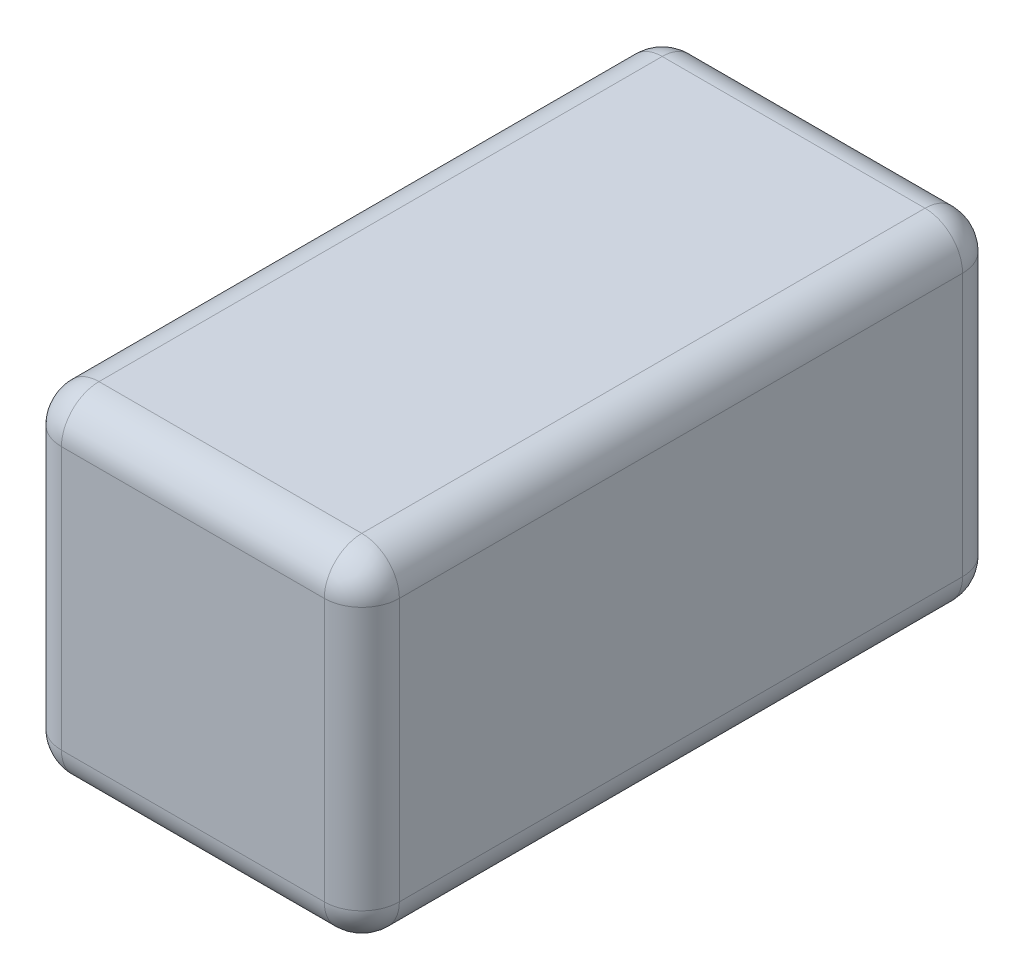
ISO-10303-21;
HEADER;
FILE_DESCRIPTION(('STEP AP214'),'2;1');
FILE_NAME('part.step','',(''),(''),'','','');
FILE_SCHEMA(('AUTOMOTIVE_DESIGN { 1 0 10303 214 1 1 1 1 }'));
ENDSEC;
DATA;
#1=APPLICATION_CONTEXT('core data for automotive mechanical design processes');
#2=APPLICATION_PROTOCOL_DEFINITION('international standard','automotive_design',2000,#1);
#3=PRODUCT_CONTEXT('',#1,'mechanical');
#4=PRODUCT('Part','Part','',(#3));
#5=PRODUCT_RELATED_PRODUCT_CATEGORY('part','',(#4));
#6=PRODUCT_DEFINITION_FORMATION('','',#4);
#7=PRODUCT_DEFINITION_CONTEXT('part definition',#1,'design');
#8=PRODUCT_DEFINITION('design','',#6,#7);
#9=PRODUCT_DEFINITION_SHAPE('','',#8);
#10=(LENGTH_UNIT() NAMED_UNIT(*) SI_UNIT(.MILLI.,.METRE.));
#11=(NAMED_UNIT(*) PLANE_ANGLE_UNIT() SI_UNIT($,.RADIAN.));
#12=(NAMED_UNIT(*) SI_UNIT($,.STERADIAN.) SOLID_ANGLE_UNIT());
#13=UNCERTAINTY_MEASURE_WITH_UNIT(LENGTH_MEASURE(1.E-05),#10,'distance_accuracy_value','');
#14=(GEOMETRIC_REPRESENTATION_CONTEXT(3) GLOBAL_UNCERTAINTY_ASSIGNED_CONTEXT((#13)) GLOBAL_UNIT_ASSIGNED_CONTEXT((#10,
#11,#12)) REPRESENTATION_CONTEXT('',''));
#15=CARTESIAN_POINT('',(0.,0.,0.));
#16=DIRECTION('',(0.,0.,1.));
#17=DIRECTION('',(1.,0.,0.));
#18=AXIS2_PLACEMENT_3D('',#15,#16,#17);
#19=CARTESIAN_POINT('',(-7.777710128787,-22.06241513081,2.799162858095));
#20=DIRECTION('',(1.,0.,0.));
#21=DIRECTION('',(0.,0.,-1.));
#22=AXIS2_PLACEMENT_3D('',#19,#20,#21);
#23=SPHERICAL_SURFACE('',#22,0.1);
#24=CARTESIAN_POINT('',(-7.777710128787,-22.06241513081,2.799162858095));
#25=DIRECTION('',(0.,0.,1.));
#26=DIRECTION('',(1.,0.,0.));
#27=AXIS2_PLACEMENT_3D('',#24,#25,#26);
#28=CIRCLE('',#27,0.1);
#29=CARTESIAN_POINT('',(-7.677710128787,-22.062415130705,2.799162858095));
#30=VERTEX_POINT('',#29);
#31=CARTESIAN_POINT('',(-7.7777101286765,-21.96241513081,2.799162858095));
#32=VERTEX_POINT('',#31);
#33=EDGE_CURVE('E91',#30,#32,#28,.T.);
#34=ORIENTED_EDGE('',*,*,#33,.F.);
#35=CARTESIAN_POINT('',(-7.777710128787,-22.06241513081,2.799162858095));
#36=DIRECTION('',(0.,1.,0.));
#37=DIRECTION('',(-1.,0.,0.));
#38=AXIS2_PLACEMENT_3D('',#35,#36,#37);
#39=CIRCLE('',#38,0.1);
#40=CARTESIAN_POINT('',(-7.777710128787,-22.06241513081,2.699162858095));
#41=VERTEX_POINT('',#40);
#42=EDGE_CURVE('E87',#41,#30,#39,.F.);
#43=ORIENTED_EDGE('',*,*,#42,.F.);
#44=CARTESIAN_POINT('',(-7.777710128787,-22.06241513081,2.799162858095));
#45=DIRECTION('',(1.,0.,0.));
#46=DIRECTION('',(0.,0.,-1.));
#47=AXIS2_PLACEMENT_3D('',#44,#45,#46);
#48=CIRCLE('',#47,0.1);
#49=EDGE_CURVE('E89',#32,#41,#48,.F.);
#50=ORIENTED_EDGE('',*,*,#49,.F.);
#51=EDGE_LOOP('',(#34,#43,#50));
#52=FACE_BOUND('',#51,.T.);
#53=ADVANCED_FACE('F17',(#52),#23,.T.);
#54=CARTESIAN_POINT('',(-7.777710128787,-22.06241513081,4.299162858095));
#55=DIRECTION('',(0.,0.,1.));
#56=DIRECTION('',(1.,0.,0.));
#57=AXIS2_PLACEMENT_3D('',#54,#55,#56);
#58=SPHERICAL_SURFACE('',#57,0.1);
#59=CARTESIAN_POINT('',(-7.777710128787,-22.06241513081,4.299162858095));
#60=DIRECTION('',(0.,-1.,0.));
#61=DIRECTION('',(1.,0.,0.));
#62=AXIS2_PLACEMENT_3D('',#59,#60,#61);
#63=CIRCLE('',#62,0.1);
#64=CARTESIAN_POINT('',(-7.677710128787,-22.06241513081,4.299162858095));
#65=VERTEX_POINT('',#64);
#66=CARTESIAN_POINT('',(-7.777710128787,-22.06241513081,4.399162858095));
#67=VERTEX_POINT('',#66);
#68=EDGE_CURVE('E53',#65,#67,#63,.T.);
#69=ORIENTED_EDGE('',*,*,#68,.F.);
#70=CARTESIAN_POINT('',(-7.777710128787,-22.06241513081,4.299162858095));
#71=DIRECTION('',(0.,0.,1.));
#72=DIRECTION('',(1.,0.,0.));
#73=AXIS2_PLACEMENT_3D('',#70,#71,#72);
#74=CIRCLE('',#73,0.1);
#75=CARTESIAN_POINT('',(-7.777710128732,-21.96241513081,4.299162858095));
#76=VERTEX_POINT('',#75);
#77=EDGE_CURVE('E120',#76,#65,#74,.F.);
#78=ORIENTED_EDGE('',*,*,#77,.F.);
#79=CARTESIAN_POINT('',(-7.777710128787,-22.06241513081,4.299162858095));
#80=DIRECTION('',(1.,0.,0.));
#81=DIRECTION('',(0.,0.,-1.));
#82=AXIS2_PLACEMENT_3D('',#79,#80,#81);
#83=CIRCLE('',#82,0.1);
#84=EDGE_CURVE('E105',#67,#76,#83,.F.);
#85=ORIENTED_EDGE('',*,*,#84,.F.);
#86=EDGE_LOOP('',(#69,#78,#85));
#87=FACE_BOUND('',#86,.T.);
#88=ADVANCED_FACE('F203',(#87),#58,.T.);
#89=CARTESIAN_POINT('',(-7.777710128787,-21.56241513081,2.799162858095));
#90=DIRECTION('',(0.,1.,0.));
#91=DIRECTION('',(-1.,0.,0.));
#92=AXIS2_PLACEMENT_3D('',#89,#90,#91);
#93=CYLINDRICAL_SURFACE('',#92,0.1);
#94=CARTESIAN_POINT('',(-7.777710128787,-22.76241513081,2.799162858095));
#95=DIRECTION('',(0.,-1.,0.));
#96=DIRECTION('',(0.,0.,-1.));
#97=AXIS2_PLACEMENT_3D('',#94,#95,#96);
#98=CIRCLE('',#97,0.1);
#99=CARTESIAN_POINT('',(-7.777710128787,-22.76241513081,2.699162858095));
#100=VERTEX_POINT('',#99);
#101=CARTESIAN_POINT('',(-7.677710128787,-22.76241513081,2.799162858095));
#102=VERTEX_POINT('',#101);
#103=EDGE_CURVE('E80',#100,#102,#98,.T.);
#104=ORIENTED_EDGE('',*,*,#103,.F.);
#105=DIRECTION('',(0.,1.,0.));
#106=VECTOR('',#105,1.);
#107=CARTESIAN_POINT('',(-7.777710128787,-21.96241513081,2.699162858095));
#108=LINE('',#107,#106);
#109=EDGE_CURVE('E107',#41,#100,#108,.F.);
#110=ORIENTED_EDGE('',*,*,#109,.F.);
#111=ORIENTED_EDGE('',*,*,#42,.T.);
#112=DIRECTION('',(0.,1.,0.));
#113=VECTOR('',#112,1.);
#114=CARTESIAN_POINT('',(-7.677710128787,-22.86241513081,2.799162858095));
#115=LINE('',#114,#113);
#116=EDGE_CURVE('E158',#30,#102,#115,.F.);
#117=ORIENTED_EDGE('',*,*,#116,.T.);
#118=EDGE_LOOP('',(#104,#110,#111,#117));
#119=FACE_BOUND('',#118,.T.);
#120=ADVANCED_FACE('F108',(#119),#93,.T.);
#121=CARTESIAN_POINT('',(-7.777710128787,-22.76241513081,2.799162858095));
#122=DIRECTION('',(0.,0.,-1.));
#123=DIRECTION('',(1.,0.,0.));
#124=AXIS2_PLACEMENT_3D('',#121,#122,#123);
#125=SPHERICAL_SURFACE('',#124,0.1);
#126=CARTESIAN_POINT('',(-7.777710128787,-22.76241513081,2.799162858095));
#127=DIRECTION('',(0.,0.,-1.));
#128=DIRECTION('',(-1.,0.,0.));
#129=AXIS2_PLACEMENT_3D('',#126,#127,#128);
#130=CIRCLE('',#129,0.1);
#131=CARTESIAN_POINT('',(-7.77771012875925,-22.86241513081,2.799162858095));
#132=VERTEX_POINT('',#131);
#133=EDGE_CURVE('E192',#132,#102,#130,.F.);
#134=ORIENTED_EDGE('',*,*,#133,.F.);
#135=CARTESIAN_POINT('',(-7.777710128787,-22.76241513081,2.799162858095));
#136=DIRECTION('',(1.,0.,0.));
#137=DIRECTION('',(0.,0.,-1.));
#138=AXIS2_PLACEMENT_3D('',#135,#136,#137);
#139=CIRCLE('',#138,0.1);
#140=EDGE_CURVE('E189',#100,#132,#139,.F.);
#141=ORIENTED_EDGE('',*,*,#140,.F.);
#142=ORIENTED_EDGE('',*,*,#103,.T.);
#143=EDGE_LOOP('',(#134,#141,#142));
#144=FACE_BOUND('',#143,.T.);
#145=ADVANCED_FACE('F176',(#144),#125,.T.);
#146=CARTESIAN_POINT('',(-7.677710128787,-22.86241513081,3.549162858095));
#147=DIRECTION('',(-1.,0.,0.));
#148=DIRECTION('',(0.,0.,1.));
#149=AXIS2_PLACEMENT_3D('',#146,#147,#148);
#150=PLANE('',#149);
#151=DIRECTION('',(0.,0.,-1.));
#152=VECTOR('',#151,1.);
#153=CARTESIAN_POINT('',(-7.677710128787,-22.76241513103,2.399162858095));
#154=LINE('',#153,#152);
#155=CARTESIAN_POINT('',(-7.677710128787,-22.76241513092,4.299162858095));
#156=VERTEX_POINT('',#155);
#157=EDGE_CURVE('E163',#102,#156,#154,.F.);
#158=ORIENTED_EDGE('',*,*,#157,.F.);
#159=ORIENTED_EDGE('',*,*,#116,.F.);
#160=DIRECTION('',(0.,0.,1.));
#161=VECTOR('',#160,1.);
#162=CARTESIAN_POINT('',(-7.677710128787,-22.06241513081,3.549162858095));
#163=LINE('',#162,#161);
#164=EDGE_CURVE('E21',#65,#30,#163,.F.);
#165=ORIENTED_EDGE('',*,*,#164,.F.);
#166=DIRECTION('',(0.,-1.,0.));
#167=VECTOR('',#166,1.);
#168=CARTESIAN_POINT('',(-7.677710128787,-23.26241513081,4.299162858095));
#169=LINE('',#168,#167);
#170=EDGE_CURVE('E61',#156,#65,#169,.F.);
#171=ORIENTED_EDGE('',*,*,#170,.F.);
#172=EDGE_LOOP('',(#158,#159,#165,#171));
#173=FACE_BOUND('',#172,.T.);
#174=ADVANCED_FACE('F171',(#173),#150,.F.);
#175=CARTESIAN_POINT('',(-7.777710128787,-22.76241513081,4.299162858095));
#176=DIRECTION('',(1.,0.,0.));
#177=DIRECTION('',(0.,0.,1.));
#178=AXIS2_PLACEMENT_3D('',#175,#176,#177);
#179=SPHERICAL_SURFACE('',#178,0.1);
#180=CARTESIAN_POINT('',(-7.777710128787,-22.76241513081,4.299162858095));
#181=DIRECTION('',(0.,-1.,0.));
#182=DIRECTION('',(1.,0.,0.));
#183=AXIS2_PLACEMENT_3D('',#180,#181,#182);
#184=CIRCLE('',#183,0.1);
#185=CARTESIAN_POINT('',(-7.777710128787,-22.76241513081,4.399162858095));
#186=VERTEX_POINT('',#185);
#187=EDGE_CURVE('E152',#186,#156,#184,.F.);
#188=ORIENTED_EDGE('',*,*,#187,.F.);
#189=CARTESIAN_POINT('',(-7.777710128787,-22.76241513081,4.299162858095));
#190=DIRECTION('',(1.,0.,0.));
#191=DIRECTION('',(0.,0.,-1.));
#192=AXIS2_PLACEMENT_3D('',#189,#190,#191);
#193=CIRCLE('',#192,0.1);
#194=CARTESIAN_POINT('',(-7.7777101286765,-22.86241513081,4.299162858095));
#195=VERTEX_POINT('',#194);
#196=EDGE_CURVE('E112',#195,#186,#193,.F.);
#197=ORIENTED_EDGE('',*,*,#196,.F.);
#198=CARTESIAN_POINT('',(-7.777710128787,-22.76241513081,4.299162858095));
#199=DIRECTION('',(0.,0.,-1.));
#200=DIRECTION('',(-1.,0.,0.));
#201=AXIS2_PLACEMENT_3D('',#198,#199,#200);
#202=CIRCLE('',#201,0.1);
#203=EDGE_CURVE('E329',#156,#195,#202,.T.);
#204=ORIENTED_EDGE('',*,*,#203,.F.);
#205=EDGE_LOOP('',(#188,#197,#204));
#206=FACE_BOUND('',#205,.T.);
#207=ADVANCED_FACE('F166',(#206),#179,.T.);
#208=CARTESIAN_POINT('',(-7.777710128787,-23.26241513081,4.299162858095));
#209=DIRECTION('',(0.,-1.,0.));
#210=DIRECTION('',(1.,0.,0.));
#211=AXIS2_PLACEMENT_3D('',#208,#209,#210);
#212=CYLINDRICAL_SURFACE('',#211,0.1);
#213=ORIENTED_EDGE('',*,*,#187,.T.);
#214=ORIENTED_EDGE('',*,*,#170,.T.);
#215=ORIENTED_EDGE('',*,*,#68,.T.);
#216=DIRECTION('',(0.,1.,0.));
#217=VECTOR('',#216,1.);
#218=CARTESIAN_POINT('',(-7.777710128787,-22.86241513081,4.399162858095));
#219=LINE('',#218,#217);
#220=EDGE_CURVE('E146',#186,#67,#219,.T.);
#221=ORIENTED_EDGE('',*,*,#220,.F.);
#222=EDGE_LOOP('',(#213,#214,#215,#221));
#223=FACE_BOUND('',#222,.T.);
#224=ADVANCED_FACE('F170',(#223),#212,.T.);
#225=CARTESIAN_POINT('',(-7.377710128787,-22.06241513081,2.799162858095));
#226=DIRECTION('',(1.,0.,0.));
#227=DIRECTION('',(0.,0.,-1.));
#228=AXIS2_PLACEMENT_3D('',#225,#226,#227);
#229=CYLINDRICAL_SURFACE('',#228,0.1);
#230=DIRECTION('',(-1.,0.,0.));
#231=VECTOR('',#230,1.);
#232=CARTESIAN_POINT('',(-7.677710128787,-22.06241513081,2.699162858095));
#233=LINE('',#232,#231);
#234=CARTESIAN_POINT('',(-8.477710128787,-22.06241513081,2.699162858095));
#235=VERTEX_POINT('',#234);
#236=EDGE_CURVE('E101',#235,#41,#233,.F.);
#237=ORIENTED_EDGE('',*,*,#236,.F.);
#238=CARTESIAN_POINT('',(-8.477710128787,-22.06241513081,2.799162858095));
#239=DIRECTION('',(1.,0.,0.));
#240=DIRECTION('',(0.,0.,-1.));
#241=AXIS2_PLACEMENT_3D('',#238,#239,#240);
#242=CIRCLE('',#241,0.1);
#243=CARTESIAN_POINT('',(-8.477710128897,-21.96241513081,2.799162858095));
#244=VERTEX_POINT('',#243);
#245=EDGE_CURVE('E308',#244,#235,#242,.F.);
#246=ORIENTED_EDGE('',*,*,#245,.F.);
#247=DIRECTION('',(-1.,0.,0.));
#248=VECTOR('',#247,1.);
#249=CARTESIAN_POINT('',(-7.677710128787,-21.96241513081,2.799162858095));
#250=LINE('',#249,#248);
#251=EDGE_CURVE('E104',#32,#244,#250,.T.);
#252=ORIENTED_EDGE('',*,*,#251,.F.);
#253=ORIENTED_EDGE('',*,*,#49,.T.);
#254=EDGE_LOOP('',(#237,#246,#252,#253));
#255=FACE_BOUND('',#254,.T.);
#256=ADVANCED_FACE('F97',(#255),#229,.T.);
#257=CARTESIAN_POINT('',(-7.377710128787,-22.06241513081,4.299162858095));
#258=DIRECTION('',(1.,0.,0.));
#259=DIRECTION('',(0.,0.,-1.));
#260=AXIS2_PLACEMENT_3D('',#257,#258,#259);
#261=CYLINDRICAL_SURFACE('',#260,0.1);
#262=DIRECTION('',(-1.,0.,0.));
#263=VECTOR('',#262,1.);
#264=CARTESIAN_POINT('',(-7.677710128787,-21.96241513081,4.299162858095));
#265=LINE('',#264,#263);
#266=CARTESIAN_POINT('',(-8.477710128787,-21.96241513081,4.299162858095));
#267=VERTEX_POINT('',#266);
#268=EDGE_CURVE('E141',#267,#76,#265,.F.);
#269=ORIENTED_EDGE('',*,*,#268,.F.);
#270=CARTESIAN_POINT('',(-8.477710128787,-22.06241513081,4.299162858095));
#271=DIRECTION('',(-1.,0.,0.));
#272=DIRECTION('',(0.,0.,1.));
#273=AXIS2_PLACEMENT_3D('',#270,#271,#272);
#274=CIRCLE('',#273,0.1);
#275=CARTESIAN_POINT('',(-8.477710128787,-22.06241513081,4.399162858095));
#276=VERTEX_POINT('',#275);
#277=EDGE_CURVE('E287',#276,#267,#274,.T.);
#278=ORIENTED_EDGE('',*,*,#277,.F.);
#279=DIRECTION('',(1.,0.,0.));
#280=VECTOR('',#279,1.);
#281=CARTESIAN_POINT('',(-7.677710128787,-22.06241513081,4.399162858095));
#282=LINE('',#281,#280);
#283=EDGE_CURVE('E324',#67,#276,#282,.F.);
#284=ORIENTED_EDGE('',*,*,#283,.F.);
#285=ORIENTED_EDGE('',*,*,#84,.T.);
#286=EDGE_LOOP('',(#269,#278,#284,#285));
#287=FACE_BOUND('',#286,.T.);
#288=ADVANCED_FACE('F428',(#287),#261,.T.);
#289=CARTESIAN_POINT('',(-7.777710128787,-22.06241513081,4.699162858095));
#290=DIRECTION('',(0.,0.,1.));
#291=DIRECTION('',(1.,0.,0.));
#292=AXIS2_PLACEMENT_3D('',#289,#290,#291);
#293=CYLINDRICAL_SURFACE('',#292,0.1);
#294=ORIENTED_EDGE('',*,*,#77,.T.);
#295=ORIENTED_EDGE('',*,*,#164,.T.);
#296=ORIENTED_EDGE('',*,*,#33,.T.);
#297=DIRECTION('',(0.,0.,1.));
#298=VECTOR('',#297,1.);
#299=CARTESIAN_POINT('',(-7.777710128787,-21.96241513081,4.399162858095));
#300=LINE('',#299,#298);
#301=EDGE_CURVE('E137',#76,#32,#300,.F.);
#302=ORIENTED_EDGE('',*,*,#301,.F.);
#303=EDGE_LOOP('',(#294,#295,#296,#302));
#304=FACE_BOUND('',#303,.T.);
#305=ADVANCED_FACE('F389',(#304),#293,.T.);
#306=CARTESIAN_POINT('',(-7.677710128787,-21.96241513081,2.699162858095));
#307=DIRECTION('',(0.,0.,-1.));
#308=DIRECTION('',(-1.,0.,0.));
#309=AXIS2_PLACEMENT_3D('',#306,#307,#308);
#310=PLANE('',#309);
#311=DIRECTION('',(1.,0.,0.));
#312=VECTOR('',#311,1.);
#313=CARTESIAN_POINT('',(-7.377710128787,-22.76241513081,2.699162858095));
#314=LINE('',#313,#312);
#315=CARTESIAN_POINT('',(-8.477710128787,-22.76241513081,2.699162858095));
#316=VERTEX_POINT('',#315);
#317=EDGE_CURVE('E193',#316,#100,#314,.T.);
#318=ORIENTED_EDGE('',*,*,#317,.F.);
#319=DIRECTION('',(0.,-1.,0.));
#320=VECTOR('',#319,1.);
#321=CARTESIAN_POINT('',(-8.477710128787,-21.56241513081,2.699162858095));
#322=LINE('',#321,#320);
#323=EDGE_CURVE('E117',#235,#316,#322,.T.);
#324=ORIENTED_EDGE('',*,*,#323,.F.);
#325=ORIENTED_EDGE('',*,*,#236,.T.);
#326=ORIENTED_EDGE('',*,*,#109,.T.);
#327=EDGE_LOOP('',(#318,#324,#325,#326));
#328=FACE_BOUND('',#327,.T.);
#329=ADVANCED_FACE('F115',(#328),#310,.T.);
#330=CARTESIAN_POINT('',(-7.377710128787,-22.76241513081,4.299162858095));
#331=DIRECTION('',(1.,0.,0.));
#332=DIRECTION('',(0.,0.,-1.));
#333=AXIS2_PLACEMENT_3D('',#330,#331,#332);
#334=CYLINDRICAL_SURFACE('',#333,0.1);
#335=DIRECTION('',(1.,0.,0.));
#336=VECTOR('',#335,1.);
#337=CARTESIAN_POINT('',(-7.677710128787,-22.76241513081,4.399162858095));
#338=LINE('',#337,#336);
#339=CARTESIAN_POINT('',(-8.477710128787,-22.76241513081,4.399162858095));
#340=VERTEX_POINT('',#339);
#341=EDGE_CURVE('E149',#340,#186,#338,.T.);
#342=ORIENTED_EDGE('',*,*,#341,.F.);
#343=CARTESIAN_POINT('',(-8.477710128787,-22.76241513081,4.299162858095));
#344=DIRECTION('',(1.,0.,0.));
#345=DIRECTION('',(0.,0.,1.));
#346=AXIS2_PLACEMENT_3D('',#343,#344,#345);
#347=CIRCLE('',#346,0.1);
#348=CARTESIAN_POINT('',(-8.477710128897,-22.86241513081,4.299162858095));
#349=VERTEX_POINT('',#348);
#350=EDGE_CURVE('E267',#349,#340,#347,.F.);
#351=ORIENTED_EDGE('',*,*,#350,.F.);
#352=DIRECTION('',(1.,0.,0.));
#353=VECTOR('',#352,1.);
#354=CARTESIAN_POINT('',(-7.677710128787,-22.86241513081,4.299162858095));
#355=LINE('',#354,#353);
#356=EDGE_CURVE('E270',#195,#349,#355,.F.);
#357=ORIENTED_EDGE('',*,*,#356,.F.);
#358=ORIENTED_EDGE('',*,*,#196,.T.);
#359=EDGE_LOOP('',(#342,#351,#357,#358));
#360=FACE_BOUND('',#359,.T.);
#361=ADVANCED_FACE('F451',(#360),#334,.T.);
#362=CARTESIAN_POINT('',(-7.377710128787,-22.76241513081,2.799162858095));
#363=DIRECTION('',(1.,0.,0.));
#364=DIRECTION('',(0.,0.,-1.));
#365=AXIS2_PLACEMENT_3D('',#362,#363,#364);
#366=CYLINDRICAL_SURFACE('',#365,0.1);
#367=DIRECTION('',(1.,0.,0.));
#368=VECTOR('',#367,1.);
#369=CARTESIAN_POINT('',(-7.677710128787,-22.86241513081,2.799162858095));
#370=LINE('',#369,#368);
#371=CARTESIAN_POINT('',(-8.47771012880417,-22.86241513081,2.799162858095));
#372=VERTEX_POINT('',#371);
#373=EDGE_CURVE('E262',#372,#132,#370,.T.);
#374=ORIENTED_EDGE('',*,*,#373,.F.);
#375=CARTESIAN_POINT('',(-8.477710128787,-22.76241513081,2.799162858095));
#376=DIRECTION('',(-1.,0.,0.));
#377=DIRECTION('',(0.,0.,-1.));
#378=AXIS2_PLACEMENT_3D('',#375,#376,#377);
#379=CIRCLE('',#378,0.0999999999999998);
#380=EDGE_CURVE('E263',#316,#372,#379,.T.);
#381=ORIENTED_EDGE('',*,*,#380,.F.);
#382=ORIENTED_EDGE('',*,*,#317,.T.);
#383=ORIENTED_EDGE('',*,*,#140,.T.);
#384=EDGE_LOOP('',(#374,#381,#382,#383));
#385=FACE_BOUND('',#384,.T.);
#386=ADVANCED_FACE('F372',(#385),#366,.T.);
#387=CARTESIAN_POINT('',(-7.777710128787,-22.76241513081,2.399162858095));
#388=DIRECTION('',(0.,0.,-1.));
#389=DIRECTION('',(-1.,0.,0.));
#390=AXIS2_PLACEMENT_3D('',#387,#388,#389);
#391=CYLINDRICAL_SURFACE('',#390,0.1);
#392=ORIENTED_EDGE('',*,*,#203,.T.);
#393=DIRECTION('',(0.,0.,1.));
#394=VECTOR('',#393,1.);
#395=CARTESIAN_POINT('',(-7.777710128787,-22.86241513081,2.699162858095));
#396=LINE('',#395,#394);
#397=EDGE_CURVE('E332',#132,#195,#396,.T.);
#398=ORIENTED_EDGE('',*,*,#397,.F.);
#399=ORIENTED_EDGE('',*,*,#133,.T.);
#400=ORIENTED_EDGE('',*,*,#157,.T.);
#401=EDGE_LOOP('',(#392,#398,#399,#400));
#402=FACE_BOUND('',#401,.T.);
#403=ADVANCED_FACE('F478',(#402),#391,.T.);
#404=CARTESIAN_POINT('',(-7.677710128787,-22.86241513081,4.399162858095));
#405=DIRECTION('',(0.,0.,1.));
#406=DIRECTION('',(1.,0.,0.));
#407=AXIS2_PLACEMENT_3D('',#404,#405,#406);
#408=PLANE('',#407);
#409=ORIENTED_EDGE('',*,*,#341,.T.);
#410=ORIENTED_EDGE('',*,*,#220,.T.);
#411=ORIENTED_EDGE('',*,*,#283,.T.);
#412=DIRECTION('',(0.,1.,0.));
#413=VECTOR('',#412,1.);
#414=CARTESIAN_POINT('',(-8.477710128787,-23.26241513081,4.399162858095));
#415=LINE('',#414,#413);
#416=EDGE_CURVE('E315',#340,#276,#415,.T.);
#417=ORIENTED_EDGE('',*,*,#416,.F.);
#418=EDGE_LOOP('',(#409,#410,#411,#417));
#419=FACE_BOUND('',#418,.T.);
#420=ADVANCED_FACE('F300',(#419),#408,.T.);
#421=CARTESIAN_POINT('',(-8.477710128787,-22.06241513081,2.799162858095));
#422=DIRECTION('',(0.,0.,-1.));
#423=DIRECTION('',(-1.,0.,0.));
#424=AXIS2_PLACEMENT_3D('',#421,#422,#423);
#425=SPHERICAL_SURFACE('',#424,0.1);
#426=CARTESIAN_POINT('',(-8.477710128787,-22.06241513081,2.799162858095));
#427=DIRECTION('',(0.,0.,-1.));
#428=DIRECTION('',(-1.,0.,0.));
#429=AXIS2_PLACEMENT_3D('',#426,#427,#428);
#430=CIRCLE('',#429,0.1);
#431=CARTESIAN_POINT('',(-8.577710128787,-22.062415130695,2.799162858095));
#432=VERTEX_POINT('',#431);
#433=EDGE_CURVE('E318',#244,#432,#430,.F.);
#434=ORIENTED_EDGE('',*,*,#433,.F.);
#435=ORIENTED_EDGE('',*,*,#245,.T.);
#436=CARTESIAN_POINT('',(-8.477710128787,-22.06241513081,2.799162858095));
#437=DIRECTION('',(0.,-1.,0.));
#438=DIRECTION('',(1.,0.,0.));
#439=AXIS2_PLACEMENT_3D('',#436,#437,#438);
#440=CIRCLE('',#439,0.1);
#441=EDGE_CURVE('E140',#432,#235,#440,.T.);
#442=ORIENTED_EDGE('',*,*,#441,.F.);
#443=EDGE_LOOP('',(#434,#435,#442));
#444=FACE_BOUND('',#443,.T.);
#445=ADVANCED_FACE('F295',(#444),#425,.T.);
#446=CARTESIAN_POINT('',(-8.477710128787,-22.06241513081,4.299162858095));
#447=DIRECTION('',(-1.,0.,0.));
#448=DIRECTION('',(0.,0.,1.));
#449=AXIS2_PLACEMENT_3D('',#446,#447,#448);
#450=SPHERICAL_SURFACE('',#449,0.1);
#451=ORIENTED_EDGE('',*,*,#277,.T.);
#452=CARTESIAN_POINT('',(-8.477710128787,-22.06241513081,4.299162858095));
#453=DIRECTION('',(0.,0.,-1.));
#454=DIRECTION('',(-1.,0.,0.));
#455=AXIS2_PLACEMENT_3D('',#452,#453,#454);
#456=CIRCLE('',#455,0.1);
#457=CARTESIAN_POINT('',(-8.577710128787,-22.06241513081,4.299162858095));
#458=VERTEX_POINT('',#457);
#459=EDGE_CURVE('E424',#458,#267,#456,.T.);
#460=ORIENTED_EDGE('',*,*,#459,.F.);
#461=CARTESIAN_POINT('',(-8.477710128787,-22.06241513081,4.299162858095));
#462=DIRECTION('',(0.,1.,0.));
#463=DIRECTION('',(-1.,0.,0.));
#464=AXIS2_PLACEMENT_3D('',#461,#462,#463);
#465=CIRCLE('',#464,0.1);
#466=EDGE_CURVE('E335',#276,#458,#465,.F.);
#467=ORIENTED_EDGE('',*,*,#466,.F.);
#468=EDGE_LOOP('',(#451,#460,#467));
#469=FACE_BOUND('',#468,.T.);
#470=ADVANCED_FACE('F290',(#469),#450,.T.);
#471=CARTESIAN_POINT('',(-7.677710128787,-21.96241513081,4.399162858095));
#472=DIRECTION('',(0.,1.,0.));
#473=DIRECTION('',(-1.,0.,0.));
#474=AXIS2_PLACEMENT_3D('',#471,#472,#473);
#475=PLANE('',#474);
#476=ORIENTED_EDGE('',*,*,#301,.T.);
#477=ORIENTED_EDGE('',*,*,#251,.T.);
#478=DIRECTION('',(0.,0.,-1.));
#479=VECTOR('',#478,1.);
#480=CARTESIAN_POINT('',(-8.477710128787,-21.96241513081,4.699162858095));
#481=LINE('',#480,#479);
#482=EDGE_CURVE('E250',#267,#244,#481,.T.);
#483=ORIENTED_EDGE('',*,*,#482,.F.);
#484=ORIENTED_EDGE('',*,*,#268,.T.);
#485=EDGE_LOOP('',(#476,#477,#483,#484));
#486=FACE_BOUND('',#485,.T.);
#487=ADVANCED_FACE('F294',(#486),#475,.T.);
#488=CARTESIAN_POINT('',(-8.477710128787,-21.56241513081,2.799162858095));
#489=DIRECTION('',(0.,-1.,0.));
#490=DIRECTION('',(1.,0.,0.));
#491=AXIS2_PLACEMENT_3D('',#488,#489,#490);
#492=CYLINDRICAL_SURFACE('',#491,0.1);
#493=CARTESIAN_POINT('',(-8.477710128787,-22.76241513081,2.799162858095));
#494=DIRECTION('',(0.,-1.,0.));
#495=DIRECTION('',(-1.,0.,0.));
#496=AXIS2_PLACEMENT_3D('',#493,#494,#495);
#497=CIRCLE('',#496,0.1);
#498=CARTESIAN_POINT('',(-8.577710128787,-22.762415130975,2.799162858095));
#499=VERTEX_POINT('',#498);
#500=EDGE_CURVE('E259',#499,#316,#497,.T.);
#501=ORIENTED_EDGE('',*,*,#500,.F.);
#502=DIRECTION('',(0.,1.,0.));
#503=VECTOR('',#502,1.);
#504=CARTESIAN_POINT('',(-8.577710128787,-22.86241513081,2.799162858095));
#505=LINE('',#504,#503);
#506=EDGE_CURVE('E246',#432,#499,#505,.F.);
#507=ORIENTED_EDGE('',*,*,#506,.F.);
#508=ORIENTED_EDGE('',*,*,#441,.T.);
#509=ORIENTED_EDGE('',*,*,#323,.T.);
#510=EDGE_LOOP('',(#501,#507,#508,#509));
#511=FACE_BOUND('',#510,.T.);
#512=ADVANCED_FACE('F441',(#511),#492,.T.);
#513=CARTESIAN_POINT('',(-8.477710128787,-22.76241513081,4.299162858095));
#514=DIRECTION('',(0.,0.,1.));
#515=DIRECTION('',(-1.,0.,0.));
#516=AXIS2_PLACEMENT_3D('',#513,#514,#515);
#517=SPHERICAL_SURFACE('',#516,0.1);
#518=ORIENTED_EDGE('',*,*,#350,.T.);
#519=CARTESIAN_POINT('',(-8.477710128787,-22.76241513081,4.299162858095));
#520=DIRECTION('',(0.,1.,0.));
#521=DIRECTION('',(-1.,0.,0.));
#522=AXIS2_PLACEMENT_3D('',#519,#520,#521);
#523=CIRCLE('',#522,0.1);
#524=CARTESIAN_POINT('',(-8.577710128787,-22.762415130925,4.299162858095));
#525=VERTEX_POINT('',#524);
#526=EDGE_CURVE('E319',#525,#340,#523,.T.);
#527=ORIENTED_EDGE('',*,*,#526,.F.);
#528=CARTESIAN_POINT('',(-8.477710128787,-22.76241513081,4.299162858095));
#529=DIRECTION('',(0.,0.,1.));
#530=DIRECTION('',(1.,0.,0.));
#531=AXIS2_PLACEMENT_3D('',#528,#529,#530);
#532=CIRCLE('',#531,0.1);
#533=EDGE_CURVE('E249',#349,#525,#532,.F.);
#534=ORIENTED_EDGE('',*,*,#533,.F.);
#535=EDGE_LOOP('',(#518,#527,#534));
#536=FACE_BOUND('',#535,.T.);
#537=ADVANCED_FACE('F237',(#536),#517,.T.);
#538=CARTESIAN_POINT('',(-8.477710128787,-22.76241513081,2.799162858095));
#539=DIRECTION('',(-1.,0.,0.));
#540=DIRECTION('',(0.,0.,-1.));
#541=AXIS2_PLACEMENT_3D('',#538,#539,#540);
#542=SPHERICAL_SURFACE('',#541,0.1);
#543=CARTESIAN_POINT('',(-8.477710128787,-22.76241513081,2.799162858095));
#544=DIRECTION('',(0.,0.,1.));
#545=DIRECTION('',(1.,0.,0.));
#546=AXIS2_PLACEMENT_3D('',#543,#544,#545);
#547=CIRCLE('',#546,0.1);
#548=EDGE_CURVE('E253',#499,#372,#547,.T.);
#549=ORIENTED_EDGE('',*,*,#548,.F.);
#550=ORIENTED_EDGE('',*,*,#500,.T.);
#551=ORIENTED_EDGE('',*,*,#380,.T.);
#552=EDGE_LOOP('',(#549,#550,#551));
#553=FACE_BOUND('',#552,.T.);
#554=ADVANCED_FACE('F232',(#553),#542,.T.);
#555=CARTESIAN_POINT('',(-7.677710128787,-22.86241513081,2.699162858095));
#556=DIRECTION('',(0.,-1.,0.));
#557=DIRECTION('',(1.,0.,0.));
#558=AXIS2_PLACEMENT_3D('',#555,#556,#557);
#559=PLANE('',#558);
#560=ORIENTED_EDGE('',*,*,#397,.T.);
#561=ORIENTED_EDGE('',*,*,#356,.T.);
#562=DIRECTION('',(0.,0.,1.));
#563=VECTOR('',#562,1.);
#564=CARTESIAN_POINT('',(-8.477710128787,-22.86241513081,2.399162858095));
#565=LINE('',#564,#563);
#566=EDGE_CURVE('E256',#372,#349,#565,.T.);
#567=ORIENTED_EDGE('',*,*,#566,.F.);
#568=ORIENTED_EDGE('',*,*,#373,.T.);
#569=EDGE_LOOP('',(#560,#561,#567,#568));
#570=FACE_BOUND('',#569,.T.);
#571=ADVANCED_FACE('F228',(#570),#559,.T.);
#572=CARTESIAN_POINT('',(-8.477710128787,-23.26241513081,4.299162858095));
#573=DIRECTION('',(0.,1.,0.));
#574=DIRECTION('',(-1.,0.,0.));
#575=AXIS2_PLACEMENT_3D('',#572,#573,#574);
#576=CYLINDRICAL_SURFACE('',#575,0.1);
#577=ORIENTED_EDGE('',*,*,#526,.T.);
#578=ORIENTED_EDGE('',*,*,#416,.T.);
#579=ORIENTED_EDGE('',*,*,#466,.T.);
#580=DIRECTION('',(0.,1.,0.));
#581=VECTOR('',#580,1.);
#582=CARTESIAN_POINT('',(-8.577710128787,-22.86241513081,4.299162858095));
#583=LINE('',#582,#581);
#584=EDGE_CURVE('E279',#525,#458,#583,.T.);
#585=ORIENTED_EDGE('',*,*,#584,.F.);
#586=EDGE_LOOP('',(#577,#578,#579,#585));
#587=FACE_BOUND('',#586,.T.);
#588=ADVANCED_FACE('F225',(#587),#576,.T.);
#589=CARTESIAN_POINT('',(-8.477710128787,-22.06241513081,4.699162858095));
#590=DIRECTION('',(0.,0.,-1.));
#591=DIRECTION('',(-1.,0.,0.));
#592=AXIS2_PLACEMENT_3D('',#589,#590,#591);
#593=CYLINDRICAL_SURFACE('',#592,0.1);
#594=ORIENTED_EDGE('',*,*,#459,.T.);
#595=ORIENTED_EDGE('',*,*,#482,.T.);
#596=ORIENTED_EDGE('',*,*,#433,.T.);
#597=DIRECTION('',(0.,0.,1.));
#598=VECTOR('',#597,1.);
#599=CARTESIAN_POINT('',(-8.577710128787,-22.06241513059,3.549162858095));
#600=LINE('',#599,#598);
#601=EDGE_CURVE('E27',#458,#432,#600,.F.);
#602=ORIENTED_EDGE('',*,*,#601,.F.);
#603=EDGE_LOOP('',(#594,#595,#596,#602));
#604=FACE_BOUND('',#603,.T.);
#605=ADVANCED_FACE('F218',(#604),#593,.T.);
#606=CARTESIAN_POINT('',(-8.477710128787,-22.76241513081,2.399162858095));
#607=DIRECTION('',(0.,0.,1.));
#608=DIRECTION('',(1.,0.,0.));
#609=AXIS2_PLACEMENT_3D('',#606,#607,#608);
#610=CYLINDRICAL_SURFACE('',#609,0.1);
#611=ORIENTED_EDGE('',*,*,#548,.T.);
#612=ORIENTED_EDGE('',*,*,#566,.T.);
#613=ORIENTED_EDGE('',*,*,#533,.T.);
#614=DIRECTION('',(0.,0.,1.));
#615=VECTOR('',#614,1.);
#616=CARTESIAN_POINT('',(-8.577710128787,-22.76241513103,3.549162858095));
#617=LINE('',#616,#615);
#618=EDGE_CURVE('E11',#499,#525,#617,.T.);
#619=ORIENTED_EDGE('',*,*,#618,.F.);
#620=EDGE_LOOP('',(#611,#612,#613,#619));
#621=FACE_BOUND('',#620,.T.);
#622=ADVANCED_FACE('F212',(#621),#610,.T.);
#623=CARTESIAN_POINT('',(-8.577710128787,-22.86241513081,3.549162858095));
#624=DIRECTION('',(-1.,0.,0.));
#625=DIRECTION('',(0.,0.,1.));
#626=AXIS2_PLACEMENT_3D('',#623,#624,#625);
#627=PLANE('',#626);
#628=ORIENTED_EDGE('',*,*,#584,.T.);
#629=ORIENTED_EDGE('',*,*,#601,.T.);
#630=ORIENTED_EDGE('',*,*,#506,.T.);
#631=ORIENTED_EDGE('',*,*,#618,.T.);
#632=EDGE_LOOP('',(#628,#629,#630,#631));
#633=FACE_BOUND('',#632,.T.);
#634=ADVANCED_FACE('F210',(#633),#627,.T.);
#635=CLOSED_SHELL('',(#53,#88,#120,#145,#174,#207,#224,#256,#288,#305,#329,#361,#386,#403,#420,
#445,#470,#487,#512,#537,#554,#571,#588,#605,#622,#634));
#636=MANIFOLD_SOLID_BREP('B1',#635);
#637=ADVANCED_BREP_SHAPE_REPRESENTATION('',(#18,#636),#14);
#638=SHAPE_DEFINITION_REPRESENTATION(#9,#637);
ENDSEC;
END-ISO-10303-21;
